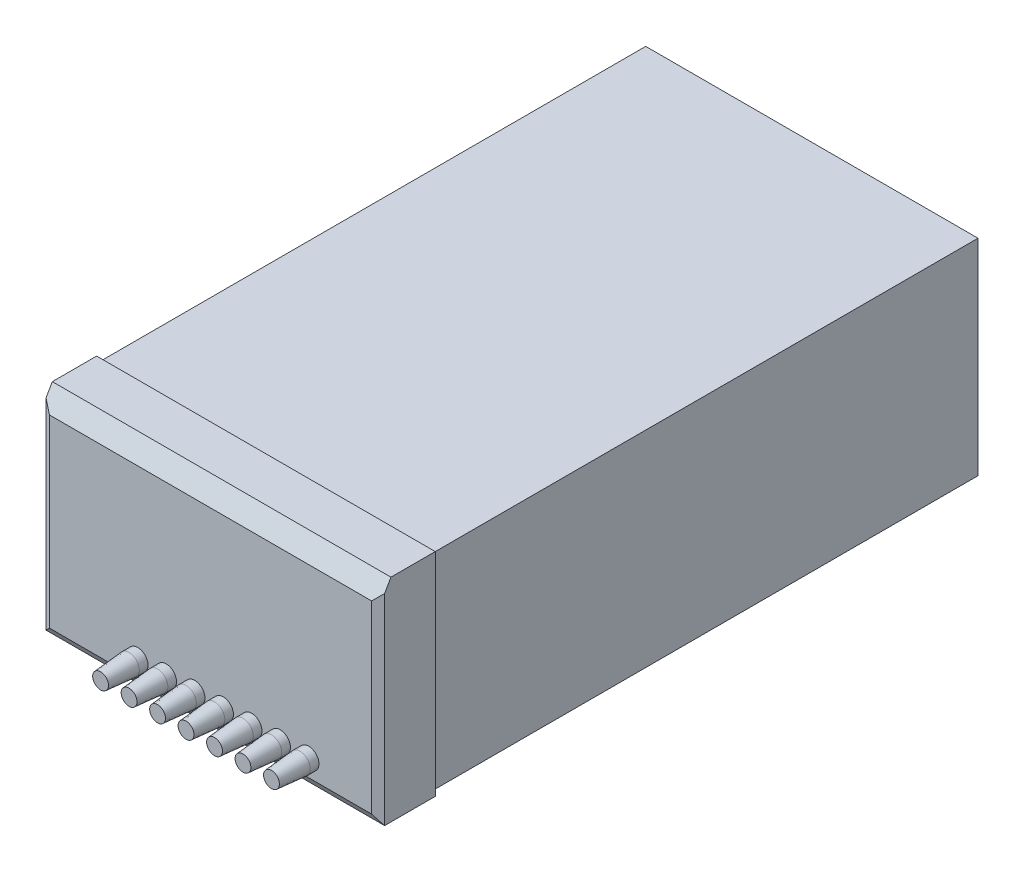
ISO-10303-21;
HEADER;
FILE_DESCRIPTION(('STEP AP214'),'2;1');
FILE_NAME('part.step','',(''),(''),'','','');
FILE_SCHEMA(('AUTOMOTIVE_DESIGN { 1 0 10303 214 1 1 1 1 }'));
ENDSEC;
DATA;
#1=APPLICATION_CONTEXT('core data for automotive mechanical design processes');
#2=APPLICATION_PROTOCOL_DEFINITION('international standard','automotive_design',2000,#1);
#3=PRODUCT_CONTEXT('',#1,'mechanical');
#4=PRODUCT('Part','Part','',(#3));
#5=PRODUCT_RELATED_PRODUCT_CATEGORY('part','',(#4));
#6=PRODUCT_DEFINITION_FORMATION('','',#4);
#7=PRODUCT_DEFINITION_CONTEXT('part definition',#1,'design');
#8=PRODUCT_DEFINITION('design','',#6,#7);
#9=PRODUCT_DEFINITION_SHAPE('','',#8);
#10=(LENGTH_UNIT() NAMED_UNIT(*) SI_UNIT(.MILLI.,.METRE.));
#11=(NAMED_UNIT(*) PLANE_ANGLE_UNIT() SI_UNIT($,.RADIAN.));
#12=(NAMED_UNIT(*) SI_UNIT($,.STERADIAN.) SOLID_ANGLE_UNIT());
#13=UNCERTAINTY_MEASURE_WITH_UNIT(LENGTH_MEASURE(1.E-05),#10,'distance_accuracy_value','');
#14=(GEOMETRIC_REPRESENTATION_CONTEXT(3) GLOBAL_UNCERTAINTY_ASSIGNED_CONTEXT((#13)) GLOBAL_UNIT_ASSIGNED_CONTEXT((#10,
#11,#12)) REPRESENTATION_CONTEXT('',''));
#15=CARTESIAN_POINT('',(0.,0.,0.));
#16=DIRECTION('',(0.,0.,1.));
#17=DIRECTION('',(1.,0.,0.));
#18=AXIS2_PLACEMENT_3D('',#15,#16,#17);
#19=CARTESIAN_POINT('',(62.,-51.,40.5));
#20=DIRECTION('',(0.,0.,-1.));
#21=DIRECTION('',(-1.,0.,0.));
#22=AXIS2_PLACEMENT_3D('',#19,#20,#21);
#23=CYLINDRICAL_SURFACE('',#22,6.5);
#24=CARTESIAN_POINT('',(62.,-51.,40.5));
#25=DIRECTION('',(0.,0.,1.));
#26=DIRECTION('',(1.,0.,0.));
#27=AXIS2_PLACEMENT_3D('',#24,#25,#26);
#28=CIRCLE('',#27,6.50000000000001);
#29=CARTESIAN_POINT('',(68.5,-51.,40.5));
#30=VERTEX_POINT('',#29);
#31=EDGE_CURVE('E12',#30,#30,#28,.T.);
#32=ORIENTED_EDGE('',*,*,#31,.F.);
#33=EDGE_LOOP('',(#32));
#34=FACE_BOUND('',#33,.T.);
#35=CARTESIAN_POINT('',(62.,-51.,35.));
#36=DIRECTION('',(0.,0.,1.));
#37=DIRECTION('',(1.,0.,0.));
#38=AXIS2_PLACEMENT_3D('',#35,#36,#37);
#39=CIRCLE('',#38,6.5);
#40=CARTESIAN_POINT('',(68.5,-51.,35.));
#41=VERTEX_POINT('',#40);
#42=EDGE_CURVE('E73',#41,#41,#39,.T.);
#43=ORIENTED_EDGE('',*,*,#42,.T.);
#44=EDGE_LOOP('',(#43));
#45=FACE_BOUND('',#44,.T.);
#46=ADVANCED_FACE('F64',(#34,#45),#23,.T.);
#47=CARTESIAN_POINT('',(62.,-51.,35.));
#48=DIRECTION('',(0.,0.,1.));
#49=DIRECTION('',(1.,0.,0.));
#50=AXIS2_PLACEMENT_3D('',#47,#48,#49);
#51=PLANE('',#50);
#52=ORIENTED_EDGE('',*,*,#42,.F.);
#53=EDGE_LOOP('',(#52));
#54=FACE_BOUND('',#53,.T.);
#55=ADVANCED_FACE('F88',(#54),#51,.F.);
#56=CARTESIAN_POINT('',(62.,-51.,58.5));
#57=DIRECTION('',(0.,0.,1.));
#58=DIRECTION('',(1.,0.,0.));
#59=AXIS2_PLACEMENT_3D('',#56,#57,#58);
#60=PLANE('',#59);
#61=CARTESIAN_POINT('',(62.,-51.,58.5));
#62=DIRECTION('',(0.,0.,1.));
#63=DIRECTION('',(1.,0.,0.));
#64=AXIS2_PLACEMENT_3D('',#61,#62,#63);
#65=CIRCLE('',#64,5.);
#66=CARTESIAN_POINT('',(67.,-51.,58.5));
#67=VERTEX_POINT('',#66);
#68=EDGE_CURVE('E78',#67,#67,#65,.T.);
#69=ORIENTED_EDGE('',*,*,#68,.T.);
#70=EDGE_LOOP('',(#69));
#71=FACE_BOUND('',#70,.T.);
#72=ADVANCED_FACE('F92',(#71),#60,.T.);
#73=CARTESIAN_POINT('',(62.,-51.,58.5));
#74=DIRECTION('',(0.,0.,-1.));
#75=DIRECTION('',(-1.,0.,0.));
#76=AXIS2_PLACEMENT_3D('',#73,#74,#75);
#77=CONICAL_SURFACE('',#76,5.,0.0831412318884415);
#78=ORIENTED_EDGE('',*,*,#31,.T.);
#79=EDGE_LOOP('',(#78));
#80=FACE_BOUND('',#79,.T.);
#81=ORIENTED_EDGE('',*,*,#68,.F.);
#82=EDGE_LOOP('',(#81));
#83=FACE_BOUND('',#82,.T.);
#84=ADVANCED_FACE('F97',(#80,#83),#77,.T.);
#85=CLOSED_SHELL('',(#46,#55,#72,#84));
#86=MANIFOLD_SOLID_BREP('B2',#85);
#87=CARTESIAN_POINT('',(44.,-51.,40.5));
#88=DIRECTION('',(0.,0.,-1.));
#89=DIRECTION('',(-1.,0.,0.));
#90=AXIS2_PLACEMENT_3D('',#87,#88,#89);
#91=CYLINDRICAL_SURFACE('',#90,6.5);
#92=CARTESIAN_POINT('',(44.,-51.,40.5));
#93=DIRECTION('',(0.,0.,1.));
#94=DIRECTION('',(1.,0.,0.));
#95=AXIS2_PLACEMENT_3D('',#92,#93,#94);
#96=CIRCLE('',#95,6.5);
#97=CARTESIAN_POINT('',(50.5,-51.,40.5));
#98=VERTEX_POINT('',#97);
#99=EDGE_CURVE('E63',#98,#98,#96,.T.);
#100=ORIENTED_EDGE('',*,*,#99,.F.);
#101=EDGE_LOOP('',(#100));
#102=FACE_BOUND('',#101,.T.);
#103=CARTESIAN_POINT('',(44.,-51.,35.));
#104=DIRECTION('',(0.,0.,1.));
#105=DIRECTION('',(1.,0.,0.));
#106=AXIS2_PLACEMENT_3D('',#103,#104,#105);
#107=CIRCLE('',#106,6.5);
#108=CARTESIAN_POINT('',(50.5,-51.,35.));
#109=VERTEX_POINT('',#108);
#110=EDGE_CURVE('E193',#109,#109,#107,.T.);
#111=ORIENTED_EDGE('',*,*,#110,.T.);
#112=EDGE_LOOP('',(#111));
#113=FACE_BOUND('',#112,.T.);
#114=ADVANCED_FACE('F184',(#102,#113),#91,.T.);
#115=CARTESIAN_POINT('',(44.,-51.,35.));
#116=DIRECTION('',(0.,0.,1.));
#117=DIRECTION('',(1.,0.,0.));
#118=AXIS2_PLACEMENT_3D('',#115,#116,#117);
#119=PLANE('',#118);
#120=ORIENTED_EDGE('',*,*,#110,.F.);
#121=EDGE_LOOP('',(#120));
#122=FACE_BOUND('',#121,.T.);
#123=ADVANCED_FACE('F208',(#122),#119,.F.);
#124=CARTESIAN_POINT('',(44.,-51.,58.5));
#125=DIRECTION('',(0.,0.,1.));
#126=DIRECTION('',(1.,0.,0.));
#127=AXIS2_PLACEMENT_3D('',#124,#125,#126);
#128=PLANE('',#127);
#129=CARTESIAN_POINT('',(44.,-51.,58.5));
#130=DIRECTION('',(0.,0.,1.));
#131=DIRECTION('',(1.,0.,0.));
#132=AXIS2_PLACEMENT_3D('',#129,#130,#131);
#133=CIRCLE('',#132,5.);
#134=CARTESIAN_POINT('',(49.,-51.,58.5));
#135=VERTEX_POINT('',#134);
#136=EDGE_CURVE('E198',#135,#135,#133,.T.);
#137=ORIENTED_EDGE('',*,*,#136,.T.);
#138=EDGE_LOOP('',(#137));
#139=FACE_BOUND('',#138,.T.);
#140=ADVANCED_FACE('F212',(#139),#128,.T.);
#141=CARTESIAN_POINT('',(44.,-51.,58.5));
#142=DIRECTION('',(0.,0.,-1.));
#143=DIRECTION('',(-1.,0.,0.));
#144=AXIS2_PLACEMENT_3D('',#141,#142,#143);
#145=CONICAL_SURFACE('',#144,5.,0.0831412318884415);
#146=ORIENTED_EDGE('',*,*,#99,.T.);
#147=EDGE_LOOP('',(#146));
#148=FACE_BOUND('',#147,.T.);
#149=ORIENTED_EDGE('',*,*,#136,.F.);
#150=EDGE_LOOP('',(#149));
#151=FACE_BOUND('',#150,.T.);
#152=ADVANCED_FACE('F217',(#148,#151),#145,.T.);
#153=CLOSED_SHELL('',(#114,#123,#140,#152));
#154=MANIFOLD_SOLID_BREP('B7',#153);
#155=CARTESIAN_POINT('',(26.,-51.,40.5));
#156=DIRECTION('',(0.,0.,-1.));
#157=DIRECTION('',(-1.,0.,0.));
#158=AXIS2_PLACEMENT_3D('',#155,#156,#157);
#159=CYLINDRICAL_SURFACE('',#158,6.5);
#160=CARTESIAN_POINT('',(26.,-51.,40.5));
#161=DIRECTION('',(0.,0.,1.));
#162=DIRECTION('',(1.,0.,0.));
#163=AXIS2_PLACEMENT_3D('',#160,#161,#162);
#164=CIRCLE('',#163,6.5);
#165=CARTESIAN_POINT('',(32.5,-51.,40.5));
#166=VERTEX_POINT('',#165);
#167=EDGE_CURVE('E183',#166,#166,#164,.T.);
#168=ORIENTED_EDGE('',*,*,#167,.F.);
#169=EDGE_LOOP('',(#168));
#170=FACE_BOUND('',#169,.T.);
#171=CARTESIAN_POINT('',(26.,-51.,35.));
#172=DIRECTION('',(0.,0.,1.));
#173=DIRECTION('',(1.,0.,0.));
#174=AXIS2_PLACEMENT_3D('',#171,#172,#173);
#175=CIRCLE('',#174,6.5);
#176=CARTESIAN_POINT('',(32.5,-51.,35.));
#177=VERTEX_POINT('',#176);
#178=EDGE_CURVE('E313',#177,#177,#175,.T.);
#179=ORIENTED_EDGE('',*,*,#178,.T.);
#180=EDGE_LOOP('',(#179));
#181=FACE_BOUND('',#180,.T.);
#182=ADVANCED_FACE('F304',(#170,#181),#159,.T.);
#183=CARTESIAN_POINT('',(26.,-51.,35.));
#184=DIRECTION('',(0.,0.,1.));
#185=DIRECTION('',(1.,0.,0.));
#186=AXIS2_PLACEMENT_3D('',#183,#184,#185);
#187=PLANE('',#186);
#188=ORIENTED_EDGE('',*,*,#178,.F.);
#189=EDGE_LOOP('',(#188));
#190=FACE_BOUND('',#189,.T.);
#191=ADVANCED_FACE('F328',(#190),#187,.F.);
#192=CARTESIAN_POINT('',(26.,-51.,58.5));
#193=DIRECTION('',(0.,0.,1.));
#194=DIRECTION('',(1.,0.,0.));
#195=AXIS2_PLACEMENT_3D('',#192,#193,#194);
#196=PLANE('',#195);
#197=CARTESIAN_POINT('',(26.,-51.,58.5));
#198=DIRECTION('',(0.,0.,1.));
#199=DIRECTION('',(1.,0.,0.));
#200=AXIS2_PLACEMENT_3D('',#197,#198,#199);
#201=CIRCLE('',#200,5.);
#202=CARTESIAN_POINT('',(31.,-51.,58.5));
#203=VERTEX_POINT('',#202);
#204=EDGE_CURVE('E318',#203,#203,#201,.T.);
#205=ORIENTED_EDGE('',*,*,#204,.T.);
#206=EDGE_LOOP('',(#205));
#207=FACE_BOUND('',#206,.T.);
#208=ADVANCED_FACE('F332',(#207),#196,.T.);
#209=CARTESIAN_POINT('',(26.,-51.,58.5));
#210=DIRECTION('',(0.,0.,-1.));
#211=DIRECTION('',(-1.,0.,0.));
#212=AXIS2_PLACEMENT_3D('',#209,#210,#211);
#213=CONICAL_SURFACE('',#212,5.,0.0831412318884415);
#214=ORIENTED_EDGE('',*,*,#167,.T.);
#215=EDGE_LOOP('',(#214));
#216=FACE_BOUND('',#215,.T.);
#217=ORIENTED_EDGE('',*,*,#204,.F.);
#218=EDGE_LOOP('',(#217));
#219=FACE_BOUND('',#218,.T.);
#220=ADVANCED_FACE('F337',(#216,#219),#213,.T.);
#221=CLOSED_SHELL('',(#182,#191,#208,#220));
#222=MANIFOLD_SOLID_BREP('B58',#221);
#223=CARTESIAN_POINT('',(7.99999999999998,-51.,40.5));
#224=DIRECTION('',(0.,0.,-1.));
#225=DIRECTION('',(-1.,0.,0.));
#226=AXIS2_PLACEMENT_3D('',#223,#224,#225);
#227=CYLINDRICAL_SURFACE('',#226,6.5);
#228=CARTESIAN_POINT('',(7.99999999999998,-51.,40.5));
#229=DIRECTION('',(0.,0.,1.));
#230=DIRECTION('',(1.,0.,0.));
#231=AXIS2_PLACEMENT_3D('',#228,#229,#230);
#232=CIRCLE('',#231,6.5);
#233=CARTESIAN_POINT('',(14.5,-51.,40.5));
#234=VERTEX_POINT('',#233);
#235=EDGE_CURVE('E303',#234,#234,#232,.T.);
#236=ORIENTED_EDGE('',*,*,#235,.F.);
#237=EDGE_LOOP('',(#236));
#238=FACE_BOUND('',#237,.T.);
#239=CARTESIAN_POINT('',(7.99999999999998,-51.,35.));
#240=DIRECTION('',(0.,0.,1.));
#241=DIRECTION('',(1.,0.,0.));
#242=AXIS2_PLACEMENT_3D('',#239,#240,#241);
#243=CIRCLE('',#242,6.5);
#244=CARTESIAN_POINT('',(14.5,-51.,35.));
#245=VERTEX_POINT('',#244);
#246=EDGE_CURVE('E433',#245,#245,#243,.T.);
#247=ORIENTED_EDGE('',*,*,#246,.T.);
#248=EDGE_LOOP('',(#247));
#249=FACE_BOUND('',#248,.T.);
#250=ADVANCED_FACE('F424',(#238,#249),#227,.T.);
#251=CARTESIAN_POINT('',(7.99999999999998,-51.,35.));
#252=DIRECTION('',(0.,0.,1.));
#253=DIRECTION('',(1.,0.,0.));
#254=AXIS2_PLACEMENT_3D('',#251,#252,#253);
#255=PLANE('',#254);
#256=ORIENTED_EDGE('',*,*,#246,.F.);
#257=EDGE_LOOP('',(#256));
#258=FACE_BOUND('',#257,.T.);
#259=ADVANCED_FACE('F448',(#258),#255,.F.);
#260=CARTESIAN_POINT('',(7.99999999999998,-51.,58.5));
#261=DIRECTION('',(0.,0.,1.));
#262=DIRECTION('',(1.,0.,0.));
#263=AXIS2_PLACEMENT_3D('',#260,#261,#262);
#264=PLANE('',#263);
#265=CARTESIAN_POINT('',(7.99999999999998,-51.,58.5));
#266=DIRECTION('',(0.,0.,1.));
#267=DIRECTION('',(1.,0.,0.));
#268=AXIS2_PLACEMENT_3D('',#265,#266,#267);
#269=CIRCLE('',#268,5.);
#270=CARTESIAN_POINT('',(13.,-51.,58.5));
#271=VERTEX_POINT('',#270);
#272=EDGE_CURVE('E438',#271,#271,#269,.T.);
#273=ORIENTED_EDGE('',*,*,#272,.T.);
#274=EDGE_LOOP('',(#273));
#275=FACE_BOUND('',#274,.T.);
#276=ADVANCED_FACE('F452',(#275),#264,.T.);
#277=CARTESIAN_POINT('',(7.99999999999998,-51.,58.5));
#278=DIRECTION('',(0.,0.,-1.));
#279=DIRECTION('',(-1.,0.,0.));
#280=AXIS2_PLACEMENT_3D('',#277,#278,#279);
#281=CONICAL_SURFACE('',#280,5.,0.0831412318884415);
#282=ORIENTED_EDGE('',*,*,#235,.T.);
#283=EDGE_LOOP('',(#282));
#284=FACE_BOUND('',#283,.T.);
#285=ORIENTED_EDGE('',*,*,#272,.F.);
#286=EDGE_LOOP('',(#285));
#287=FACE_BOUND('',#286,.T.);
#288=ADVANCED_FACE('F457',(#284,#287),#281,.T.);
#289=CLOSED_SHELL('',(#250,#259,#276,#288));
#290=MANIFOLD_SOLID_BREP('B178',#289);
#291=CARTESIAN_POINT('',(-10.,-51.,40.5));
#292=DIRECTION('',(0.,0.,-1.));
#293=DIRECTION('',(-1.,0.,0.));
#294=AXIS2_PLACEMENT_3D('',#291,#292,#293);
#295=CYLINDRICAL_SURFACE('',#294,6.5);
#296=CARTESIAN_POINT('',(-10.,-51.,40.5));
#297=DIRECTION('',(0.,0.,1.));
#298=DIRECTION('',(1.,0.,0.));
#299=AXIS2_PLACEMENT_3D('',#296,#297,#298);
#300=CIRCLE('',#299,6.5);
#301=CARTESIAN_POINT('',(-3.50000000000002,-51.,40.5));
#302=VERTEX_POINT('',#301);
#303=EDGE_CURVE('E423',#302,#302,#300,.T.);
#304=ORIENTED_EDGE('',*,*,#303,.F.);
#305=EDGE_LOOP('',(#304));
#306=FACE_BOUND('',#305,.T.);
#307=CARTESIAN_POINT('',(-10.,-51.,35.));
#308=DIRECTION('',(0.,0.,1.));
#309=DIRECTION('',(1.,0.,0.));
#310=AXIS2_PLACEMENT_3D('',#307,#308,#309);
#311=CIRCLE('',#310,6.5);
#312=CARTESIAN_POINT('',(-3.50000000000002,-51.,35.));
#313=VERTEX_POINT('',#312);
#314=EDGE_CURVE('E553',#313,#313,#311,.T.);
#315=ORIENTED_EDGE('',*,*,#314,.T.);
#316=EDGE_LOOP('',(#315));
#317=FACE_BOUND('',#316,.T.);
#318=ADVANCED_FACE('F544',(#306,#317),#295,.T.);
#319=CARTESIAN_POINT('',(-10.,-51.,35.));
#320=DIRECTION('',(0.,0.,1.));
#321=DIRECTION('',(1.,0.,0.));
#322=AXIS2_PLACEMENT_3D('',#319,#320,#321);
#323=PLANE('',#322);
#324=ORIENTED_EDGE('',*,*,#314,.F.);
#325=EDGE_LOOP('',(#324));
#326=FACE_BOUND('',#325,.T.);
#327=ADVANCED_FACE('F568',(#326),#323,.F.);
#328=CARTESIAN_POINT('',(-10.,-51.,58.5));
#329=DIRECTION('',(0.,0.,1.));
#330=DIRECTION('',(1.,0.,0.));
#331=AXIS2_PLACEMENT_3D('',#328,#329,#330);
#332=PLANE('',#331);
#333=CARTESIAN_POINT('',(-10.,-51.,58.5));
#334=DIRECTION('',(0.,0.,1.));
#335=DIRECTION('',(1.,0.,0.));
#336=AXIS2_PLACEMENT_3D('',#333,#334,#335);
#337=CIRCLE('',#336,5.);
#338=CARTESIAN_POINT('',(-5.00000000000002,-51.,58.5));
#339=VERTEX_POINT('',#338);
#340=EDGE_CURVE('E558',#339,#339,#337,.T.);
#341=ORIENTED_EDGE('',*,*,#340,.T.);
#342=EDGE_LOOP('',(#341));
#343=FACE_BOUND('',#342,.T.);
#344=ADVANCED_FACE('F572',(#343),#332,.T.);
#345=CARTESIAN_POINT('',(-10.,-51.,58.5));
#346=DIRECTION('',(0.,0.,-1.));
#347=DIRECTION('',(-1.,0.,0.));
#348=AXIS2_PLACEMENT_3D('',#345,#346,#347);
#349=CONICAL_SURFACE('',#348,5.,0.0831412318884415);
#350=ORIENTED_EDGE('',*,*,#303,.T.);
#351=EDGE_LOOP('',(#350));
#352=FACE_BOUND('',#351,.T.);
#353=ORIENTED_EDGE('',*,*,#340,.F.);
#354=EDGE_LOOP('',(#353));
#355=FACE_BOUND('',#354,.T.);
#356=ADVANCED_FACE('F577',(#352,#355),#349,.T.);
#357=CLOSED_SHELL('',(#318,#327,#344,#356));
#358=MANIFOLD_SOLID_BREP('B298',#357);
#359=CARTESIAN_POINT('',(-28.,-51.,40.5));
#360=DIRECTION('',(0.,0.,-1.));
#361=DIRECTION('',(-1.,0.,0.));
#362=AXIS2_PLACEMENT_3D('',#359,#360,#361);
#363=CYLINDRICAL_SURFACE('',#362,6.5);
#364=CARTESIAN_POINT('',(-28.,-51.,40.5));
#365=DIRECTION('',(0.,0.,1.));
#366=DIRECTION('',(1.,0.,0.));
#367=AXIS2_PLACEMENT_3D('',#364,#365,#366);
#368=CIRCLE('',#367,6.5);
#369=CARTESIAN_POINT('',(-21.5,-51.,40.5));
#370=VERTEX_POINT('',#369);
#371=EDGE_CURVE('E543',#370,#370,#368,.T.);
#372=ORIENTED_EDGE('',*,*,#371,.F.);
#373=EDGE_LOOP('',(#372));
#374=FACE_BOUND('',#373,.T.);
#375=CARTESIAN_POINT('',(-28.,-51.,35.));
#376=DIRECTION('',(0.,0.,1.));
#377=DIRECTION('',(1.,0.,0.));
#378=AXIS2_PLACEMENT_3D('',#375,#376,#377);
#379=CIRCLE('',#378,6.5);
#380=CARTESIAN_POINT('',(-21.5,-51.,35.));
#381=VERTEX_POINT('',#380);
#382=EDGE_CURVE('E673',#381,#381,#379,.T.);
#383=ORIENTED_EDGE('',*,*,#382,.T.);
#384=EDGE_LOOP('',(#383));
#385=FACE_BOUND('',#384,.T.);
#386=ADVANCED_FACE('F664',(#374,#385),#363,.T.);
#387=CARTESIAN_POINT('',(-28.,-51.,35.));
#388=DIRECTION('',(0.,0.,1.));
#389=DIRECTION('',(1.,0.,0.));
#390=AXIS2_PLACEMENT_3D('',#387,#388,#389);
#391=PLANE('',#390);
#392=ORIENTED_EDGE('',*,*,#382,.F.);
#393=EDGE_LOOP('',(#392));
#394=FACE_BOUND('',#393,.T.);
#395=ADVANCED_FACE('F688',(#394),#391,.F.);
#396=CARTESIAN_POINT('',(-28.,-51.,58.5));
#397=DIRECTION('',(0.,0.,1.));
#398=DIRECTION('',(1.,0.,0.));
#399=AXIS2_PLACEMENT_3D('',#396,#397,#398);
#400=PLANE('',#399);
#401=CARTESIAN_POINT('',(-28.,-51.,58.5));
#402=DIRECTION('',(0.,0.,1.));
#403=DIRECTION('',(1.,0.,0.));
#404=AXIS2_PLACEMENT_3D('',#401,#402,#403);
#405=CIRCLE('',#404,5.);
#406=CARTESIAN_POINT('',(-23.,-51.,58.5));
#407=VERTEX_POINT('',#406);
#408=EDGE_CURVE('E678',#407,#407,#405,.T.);
#409=ORIENTED_EDGE('',*,*,#408,.T.);
#410=EDGE_LOOP('',(#409));
#411=FACE_BOUND('',#410,.T.);
#412=ADVANCED_FACE('F692',(#411),#400,.T.);
#413=CARTESIAN_POINT('',(-28.,-51.,58.5));
#414=DIRECTION('',(0.,0.,-1.));
#415=DIRECTION('',(-1.,0.,0.));
#416=AXIS2_PLACEMENT_3D('',#413,#414,#415);
#417=CONICAL_SURFACE('',#416,5.,0.0831412318884415);
#418=ORIENTED_EDGE('',*,*,#371,.T.);
#419=EDGE_LOOP('',(#418));
#420=FACE_BOUND('',#419,.T.);
#421=ORIENTED_EDGE('',*,*,#408,.F.);
#422=EDGE_LOOP('',(#421));
#423=FACE_BOUND('',#422,.T.);
#424=ADVANCED_FACE('F697',(#420,#423),#417,.T.);
#425=CLOSED_SHELL('',(#386,#395,#412,#424));
#426=MANIFOLD_SOLID_BREP('B418',#425);
#427=CARTESIAN_POINT('',(-46.,-51.,40.5));
#428=DIRECTION('',(0.,0.,-1.));
#429=DIRECTION('',(-1.,0.,0.));
#430=AXIS2_PLACEMENT_3D('',#427,#428,#429);
#431=CYLINDRICAL_SURFACE('',#430,6.5);
#432=CARTESIAN_POINT('',(-46.,-51.,40.5));
#433=DIRECTION('',(0.,0.,-1.));
#434=DIRECTION('',(-1.,0.,0.));
#435=AXIS2_PLACEMENT_3D('',#432,#433,#434);
#436=CIRCLE('',#435,6.5);
#437=CARTESIAN_POINT('',(-52.5,-51.,40.5));
#438=VERTEX_POINT('',#437);
#439=EDGE_CURVE('E663',#438,#438,#436,.F.);
#440=ORIENTED_EDGE('',*,*,#439,.F.);
#441=EDGE_LOOP('',(#440));
#442=FACE_BOUND('',#441,.T.);
#443=CARTESIAN_POINT('',(-46.,-51.,35.));
#444=DIRECTION('',(0.,0.,1.));
#445=DIRECTION('',(1.,0.,0.));
#446=AXIS2_PLACEMENT_3D('',#443,#444,#445);
#447=CIRCLE('',#446,6.5);
#448=CARTESIAN_POINT('',(-39.5,-51.,35.));
#449=VERTEX_POINT('',#448);
#450=EDGE_CURVE('E793',#449,#449,#447,.T.);
#451=ORIENTED_EDGE('',*,*,#450,.T.);
#452=EDGE_LOOP('',(#451));
#453=FACE_BOUND('',#452,.T.);
#454=ADVANCED_FACE('F786',(#442,#453),#431,.T.);
#455=CARTESIAN_POINT('',(-46.,-51.,35.));
#456=DIRECTION('',(0.,0.,1.));
#457=DIRECTION('',(1.,0.,0.));
#458=AXIS2_PLACEMENT_3D('',#455,#456,#457);
#459=PLANE('',#458);
#460=ORIENTED_EDGE('',*,*,#450,.F.);
#461=EDGE_LOOP('',(#460));
#462=FACE_BOUND('',#461,.T.);
#463=ADVANCED_FACE('F819',(#462),#459,.F.);
#464=CARTESIAN_POINT('',(-46.,-51.,58.5));
#465=DIRECTION('',(0.,0.,1.));
#466=DIRECTION('',(1.,0.,0.));
#467=AXIS2_PLACEMENT_3D('',#464,#465,#466);
#468=PLANE('',#467);
#469=CARTESIAN_POINT('',(-46.,-51.,58.5));
#470=DIRECTION('',(0.,0.,1.));
#471=DIRECTION('',(1.,0.,0.));
#472=AXIS2_PLACEMENT_3D('',#469,#470,#471);
#473=CIRCLE('',#472,5.);
#474=CARTESIAN_POINT('',(-41.,-51.,58.5));
#475=VERTEX_POINT('',#474);
#476=EDGE_CURVE('E797',#475,#475,#473,.T.);
#477=ORIENTED_EDGE('',*,*,#476,.T.);
#478=EDGE_LOOP('',(#477));
#479=FACE_BOUND('',#478,.T.);
#480=ADVANCED_FACE('F809',(#479),#468,.T.);
#481=CARTESIAN_POINT('',(-46.,-51.,58.5));
#482=DIRECTION('',(0.,0.,-1.));
#483=DIRECTION('',(-1.,0.,0.));
#484=AXIS2_PLACEMENT_3D('',#481,#482,#483);
#485=CONICAL_SURFACE('',#484,5.,0.0831412318884415);
#486=ORIENTED_EDGE('',*,*,#439,.T.);
#487=EDGE_LOOP('',(#486));
#488=FACE_BOUND('',#487,.T.);
#489=ORIENTED_EDGE('',*,*,#476,.F.);
#490=EDGE_LOOP('',(#489));
#491=FACE_BOUND('',#490,.T.);
#492=ADVANCED_FACE('F818',(#488,#491),#485,.T.);
#493=CLOSED_SHELL('',(#454,#463,#480,#492));
#494=MANIFOLD_SOLID_BREP('B538',#493);
#495=CARTESIAN_POINT('',(-107.,-67.,35.));
#496=DIRECTION('',(0.,1.,0.));
#497=DIRECTION('',(0.,0.,1.));
#498=AXIS2_PLACEMENT_3D('',#495,#496,#497);
#499=PLANE('',#498);
#500=DIRECTION('',(0.,0.,-1.));
#501=VECTOR('',#500,1.);
#502=CARTESIAN_POINT('',(107.,-67.,35.));
#503=LINE('',#502,#501);
#504=CARTESIAN_POINT('',(107.,-67.,32.));
#505=VERTEX_POINT('',#504);
#506=CARTESIAN_POINT('',(107.,-67.,0.));
#507=VERTEX_POINT('',#506);
#508=EDGE_CURVE('E949',#505,#507,#503,.T.);
#509=ORIENTED_EDGE('',*,*,#508,.F.);
#510=DIRECTION('',(-1.,0.,0.));
#511=VECTOR('',#510,1.);
#512=CARTESIAN_POINT('',(-107.,-67.,32.));
#513=LINE('',#512,#511);
#514=CARTESIAN_POINT('',(-107.,-67.,32.));
#515=VERTEX_POINT('',#514);
#516=EDGE_CURVE('E900',#505,#515,#513,.T.);
#517=ORIENTED_EDGE('',*,*,#516,.T.);
#518=DIRECTION('',(0.,0.,-1.));
#519=VECTOR('',#518,1.);
#520=CARTESIAN_POINT('',(-107.,-67.,35.));
#521=LINE('',#520,#519);
#522=CARTESIAN_POINT('',(-107.,-67.,0.));
#523=VERTEX_POINT('',#522);
#524=EDGE_CURVE('E967',#515,#523,#521,.T.);
#525=ORIENTED_EDGE('',*,*,#524,.T.);
#526=DIRECTION('',(1.,0.,0.));
#527=VECTOR('',#526,1.);
#528=CARTESIAN_POINT('',(-107.,-67.,0.));
#529=LINE('',#528,#527);
#530=EDGE_CURVE('E963',#523,#507,#529,.T.);
#531=ORIENTED_EDGE('',*,*,#530,.T.);
#532=EDGE_LOOP('',(#509,#517,#525,#531));
#533=FACE_BOUND('',#532,.T.);
#534=ADVANCED_FACE('F890',(#533),#499,.F.);
#535=CARTESIAN_POINT('',(107.,-67.,35.));
#536=DIRECTION('',(-1.,0.,0.));
#537=DIRECTION('',(0.,0.,1.));
#538=AXIS2_PLACEMENT_3D('',#535,#536,#537);
#539=PLANE('',#538);
#540=DIRECTION('',(0.,-0.866025403784438,0.500000000000002));
#541=VECTOR('',#540,1.);
#542=CARTESIAN_POINT('',(107.,54.8756443470179,35.));
#543=LINE('',#542,#541);
#544=CARTESIAN_POINT('',(107.,67.,28.));
#545=VERTEX_POINT('',#544);
#546=CARTESIAN_POINT('',(107.,60.0717967697245,32.));
#547=VERTEX_POINT('',#546);
#548=EDGE_CURVE('E986',#545,#547,#543,.T.);
#549=ORIENTED_EDGE('',*,*,#548,.T.);
#550=DIRECTION('',(0.,-1.,0.));
#551=VECTOR('',#550,1.);
#552=CARTESIAN_POINT('',(107.,-67.,32.));
#553=LINE('',#552,#551);
#554=EDGE_CURVE('E915',#547,#505,#553,.T.);
#555=ORIENTED_EDGE('',*,*,#554,.T.);
#556=ORIENTED_EDGE('',*,*,#508,.T.);
#557=DIRECTION('',(0.,1.,0.));
#558=VECTOR('',#557,1.);
#559=CARTESIAN_POINT('',(107.,-67.,0.));
#560=LINE('',#559,#558);
#561=CARTESIAN_POINT('',(107.,67.,0.));
#562=VERTEX_POINT('',#561);
#563=EDGE_CURVE('E953',#507,#562,#560,.T.);
#564=ORIENTED_EDGE('',*,*,#563,.T.);
#565=DIRECTION('',(0.,0.,-1.));
#566=VECTOR('',#565,1.);
#567=CARTESIAN_POINT('',(107.,67.,35.));
#568=LINE('',#567,#566);
#569=EDGE_CURVE('E957',#545,#562,#568,.T.);
#570=ORIENTED_EDGE('',*,*,#569,.F.);
#571=EDGE_LOOP('',(#549,#555,#556,#564,#570));
#572=FACE_BOUND('',#571,.T.);
#573=ADVANCED_FACE('F951',(#572),#539,.F.);
#574=CARTESIAN_POINT('',(107.,67.,35.));
#575=DIRECTION('',(0.,-1.,0.));
#576=DIRECTION('',(0.,0.,-1.));
#577=AXIS2_PLACEMENT_3D('',#574,#575,#576);
#578=PLANE('',#577);
#579=DIRECTION('',(0.,0.,-1.));
#580=VECTOR('',#579,1.);
#581=CARTESIAN_POINT('',(-107.,67.,35.));
#582=LINE('',#581,#580);
#583=CARTESIAN_POINT('',(-107.,67.,28.));
#584=VERTEX_POINT('',#583);
#585=CARTESIAN_POINT('',(-107.,67.,0.));
#586=VERTEX_POINT('',#585);
#587=EDGE_CURVE('E977',#584,#586,#582,.T.);
#588=ORIENTED_EDGE('',*,*,#587,.F.);
#589=DIRECTION('',(1.,0.,0.));
#590=VECTOR('',#589,1.);
#591=CARTESIAN_POINT('',(107.,67.,28.));
#592=LINE('',#591,#590);
#593=EDGE_CURVE('E984',#584,#545,#592,.T.);
#594=ORIENTED_EDGE('',*,*,#593,.T.);
#595=ORIENTED_EDGE('',*,*,#569,.T.);
#596=DIRECTION('',(-1.,0.,0.));
#597=VECTOR('',#596,1.);
#598=CARTESIAN_POINT('',(107.,67.,0.));
#599=LINE('',#598,#597);
#600=EDGE_CURVE('E965',#562,#586,#599,.T.);
#601=ORIENTED_EDGE('',*,*,#600,.T.);
#602=EDGE_LOOP('',(#588,#594,#595,#601));
#603=FACE_BOUND('',#602,.T.);
#604=ADVANCED_FACE('F1023',(#603),#578,.F.);
#605=CARTESIAN_POINT('',(-107.,67.,35.));
#606=DIRECTION('',(1.,0.,0.));
#607=DIRECTION('',(0.,0.,-1.));
#608=AXIS2_PLACEMENT_3D('',#605,#606,#607);
#609=PLANE('',#608);
#610=ORIENTED_EDGE('',*,*,#524,.F.);
#611=DIRECTION('',(0.,1.,0.));
#612=VECTOR('',#611,1.);
#613=CARTESIAN_POINT('',(-107.,54.8756443470179,32.));
#614=LINE('',#613,#612);
#615=CARTESIAN_POINT('',(-107.,60.0717967697245,32.));
#616=VERTEX_POINT('',#615);
#617=EDGE_CURVE('E784',#515,#616,#614,.T.);
#618=ORIENTED_EDGE('',*,*,#617,.T.);
#619=DIRECTION('',(0.,0.866025403784438,-0.500000000000002));
#620=VECTOR('',#619,1.);
#621=CARTESIAN_POINT('',(-107.,54.8756443470179,35.));
#622=LINE('',#621,#620);
#623=EDGE_CURVE('E982',#616,#584,#622,.T.);
#624=ORIENTED_EDGE('',*,*,#623,.T.);
#625=ORIENTED_EDGE('',*,*,#587,.T.);
#626=DIRECTION('',(0.,-1.,0.));
#627=VECTOR('',#626,1.);
#628=CARTESIAN_POINT('',(-107.,67.,0.));
#629=LINE('',#628,#627);
#630=EDGE_CURVE('E974',#586,#523,#629,.T.);
#631=ORIENTED_EDGE('',*,*,#630,.T.);
#632=EDGE_LOOP('',(#610,#618,#624,#625,#631));
#633=FACE_BOUND('',#632,.T.);
#634=ADVANCED_FACE('F1015',(#633),#609,.F.);
#635=CARTESIAN_POINT('',(0.,0.,35.));
#636=DIRECTION('',(0.,0.,1.));
#637=DIRECTION('',(1.,0.,0.));
#638=AXIS2_PLACEMENT_3D('',#635,#636,#637);
#639=PLANE('',#638);
#640=DIRECTION('',(1.,0.,0.));
#641=VECTOR('',#640,1.);
#642=CARTESIAN_POINT('',(107.,-61.8038475772934,35.));
#643=LINE('',#642,#641);
#644=CARTESIAN_POINT('',(-101.803847577293,-61.8038475772934,35.));
#645=VERTEX_POINT('',#644);
#646=CARTESIAN_POINT('',(101.803847577293,-61.8038475772934,35.));
#647=VERTEX_POINT('',#646);
#648=EDGE_CURVE('E990',#645,#647,#643,.T.);
#649=ORIENTED_EDGE('',*,*,#648,.T.);
#650=DIRECTION('',(0.,1.,0.));
#651=VECTOR('',#650,1.);
#652=CARTESIAN_POINT('',(101.803847577293,54.8756443470179,35.));
#653=LINE('',#652,#651);
#654=CARTESIAN_POINT('',(101.803847577293,54.8756443470179,35.));
#655=VERTEX_POINT('',#654);
#656=EDGE_CURVE('E992',#647,#655,#653,.T.);
#657=ORIENTED_EDGE('',*,*,#656,.T.);
#658=DIRECTION('',(-1.,0.,0.));
#659=VECTOR('',#658,1.);
#660=CARTESIAN_POINT('',(-107.,54.8756443470179,35.));
#661=LINE('',#660,#659);
#662=CARTESIAN_POINT('',(-101.803847577293,54.8756443470179,35.));
#663=VERTEX_POINT('',#662);
#664=EDGE_CURVE('E956',#655,#663,#661,.T.);
#665=ORIENTED_EDGE('',*,*,#664,.T.);
#666=DIRECTION('',(0.,-1.,0.));
#667=VECTOR('',#666,1.);
#668=CARTESIAN_POINT('',(-101.803847577293,-67.,35.));
#669=LINE('',#668,#667);
#670=EDGE_CURVE('E988',#663,#645,#669,.T.);
#671=ORIENTED_EDGE('',*,*,#670,.T.);
#672=EDGE_LOOP('',(#649,#657,#665,#671));
#673=FACE_BOUND('',#672,.T.);
#674=ADVANCED_FACE('F1030',(#673),#639,.T.);
#675=CARTESIAN_POINT('',(0.,0.,0.));
#676=DIRECTION('',(0.,0.,1.));
#677=DIRECTION('',(1.,0.,0.));
#678=AXIS2_PLACEMENT_3D('',#675,#676,#677);
#679=PLANE('',#678);
#680=ORIENTED_EDGE('',*,*,#530,.F.);
#681=ORIENTED_EDGE('',*,*,#630,.F.);
#682=ORIENTED_EDGE('',*,*,#600,.F.);
#683=ORIENTED_EDGE('',*,*,#563,.F.);
#684=EDGE_LOOP('',(#680,#681,#682,#683));
#685=FACE_BOUND('',#684,.T.);
#686=ADVANCED_FACE('F961',(#685),#679,.F.);
#687=CARTESIAN_POINT('',(0.,54.8756443470179,35.));
#688=DIRECTION('',(0.,0.500000000000002,0.866025403784438));
#689=DIRECTION('',(1.,0.,0.));
#690=AXIS2_PLACEMENT_3D('',#687,#688,#689);
#691=PLANE('',#690);
#692=ORIENTED_EDGE('',*,*,#664,.F.);
#693=DIRECTION('',(0.654653670707975,0.654653670707978,-0.37796447300923));
#694=VECTOR('',#693,1.);
#695=CARTESIAN_POINT('',(58.1736271870251,11.2454239567494,60.1899194871243));
#696=LINE('',#695,#694);
#697=EDGE_CURVE('E997',#655,#547,#696,.T.);
#698=ORIENTED_EDGE('',*,*,#697,.T.);
#699=ORIENTED_EDGE('',*,*,#548,.F.);
#700=ORIENTED_EDGE('',*,*,#593,.F.);
#701=ORIENTED_EDGE('',*,*,#623,.F.);
#702=DIRECTION('',(0.654653670707975,-0.654653670707978,0.37796447300923));
#703=VECTOR('',#702,1.);
#704=CARTESIAN_POINT('',(-58.1736271870252,11.2454239567494,60.1899194871243));
#705=LINE('',#704,#703);
#706=EDGE_CURVE('E995',#616,#663,#705,.T.);
#707=ORIENTED_EDGE('',*,*,#706,.T.);
#708=EDGE_LOOP('',(#692,#698,#699,#700,#701,#707));
#709=FACE_BOUND('',#708,.T.);
#710=ADVANCED_FACE('F1020',(#709),#691,.T.);
#711=CARTESIAN_POINT('',(-101.803847577293,0.,35.));
#712=DIRECTION('',(-0.500000000000004,0.,0.866025403784436));
#713=DIRECTION('',(0.,1.,0.));
#714=AXIS2_PLACEMENT_3D('',#711,#712,#713);
#715=PLANE('',#714);
#716=ORIENTED_EDGE('',*,*,#706,.F.);
#717=ORIENTED_EDGE('',*,*,#617,.F.);
#718=DIRECTION('',(0.654653670707976,0.654653670707976,0.377964473009231));
#719=VECTOR('',#718,1.);
#720=CARTESIAN_POINT('',(-75.316484329882,-35.316484329882,50.2924863010165));
#721=LINE('',#720,#719);
#722=EDGE_CURVE('E895',#645,#515,#721,.F.);
#723=ORIENTED_EDGE('',*,*,#722,.F.);
#724=ORIENTED_EDGE('',*,*,#670,.F.);
#725=EDGE_LOOP('',(#716,#717,#723,#724));
#726=FACE_BOUND('',#725,.T.);
#727=ADVANCED_FACE('F893',(#726),#715,.T.);
#728=CARTESIAN_POINT('',(0.,-61.8038475772934,35.));
#729=DIRECTION('',(0.,-0.500000000000004,0.866025403784436));
#730=DIRECTION('',(-1.,0.,0.));
#731=AXIS2_PLACEMENT_3D('',#728,#729,#730);
#732=PLANE('',#731);
#733=ORIENTED_EDGE('',*,*,#722,.T.);
#734=ORIENTED_EDGE('',*,*,#516,.F.);
#735=DIRECTION('',(-0.654653670707976,0.654653670707976,0.377964473009231));
#736=VECTOR('',#735,1.);
#737=CARTESIAN_POINT('',(58.1736271870249,-18.1736271870249,60.1899194871245));
#738=LINE('',#737,#736);
#739=EDGE_CURVE('E971',#647,#505,#738,.F.);
#740=ORIENTED_EDGE('',*,*,#739,.F.);
#741=ORIENTED_EDGE('',*,*,#648,.F.);
#742=EDGE_LOOP('',(#733,#734,#740,#741));
#743=FACE_BOUND('',#742,.T.);
#744=ADVANCED_FACE('F1007',(#743),#732,.T.);
#745=CARTESIAN_POINT('',(101.803847577293,0.,35.));
#746=DIRECTION('',(0.500000000000004,0.,0.866025403784436));
#747=DIRECTION('',(0.,-1.,0.));
#748=AXIS2_PLACEMENT_3D('',#745,#746,#747);
#749=PLANE('',#748);
#750=ORIENTED_EDGE('',*,*,#739,.T.);
#751=ORIENTED_EDGE('',*,*,#554,.F.);
#752=ORIENTED_EDGE('',*,*,#697,.F.);
#753=ORIENTED_EDGE('',*,*,#656,.F.);
#754=EDGE_LOOP('',(#750,#751,#752,#753));
#755=FACE_BOUND('',#754,.T.);
#756=ADVANCED_FACE('F1004',(#755),#749,.T.);
#757=CLOSED_SHELL('',(#534,#573,#604,#634,#674,#686,#710,#727,#744,#756));
#758=MANIFOLD_SOLID_BREP('B658',#757);
#759=CARTESIAN_POINT('',(105.,-65.,-345.));
#760=DIRECTION('',(1.,0.,0.));
#761=DIRECTION('',(0.,0.,-1.));
#762=AXIS2_PLACEMENT_3D('',#759,#760,#761);
#763=PLANE('',#762);
#764=DIRECTION('',(0.,1.,0.));
#765=VECTOR('',#764,1.);
#766=CARTESIAN_POINT('',(105.,-65.,0.));
#767=LINE('',#766,#765);
#768=CARTESIAN_POINT('',(105.,-65.,0.));
#769=VERTEX_POINT('',#768);
#770=CARTESIAN_POINT('',(105.,65.,0.));
#771=VERTEX_POINT('',#770);
#772=EDGE_CURVE('E1188',#769,#771,#767,.T.);
#773=ORIENTED_EDGE('',*,*,#772,.F.);
#774=DIRECTION('',(0.,0.,1.));
#775=VECTOR('',#774,1.);
#776=CARTESIAN_POINT('',(105.,-65.,-345.));
#777=LINE('',#776,#775);
#778=CARTESIAN_POINT('',(105.,-65.,-345.));
#779=VERTEX_POINT('',#778);
#780=EDGE_CURVE('E888',#779,#769,#777,.T.);
#781=ORIENTED_EDGE('',*,*,#780,.F.);
#782=DIRECTION('',(0.,1.,0.));
#783=VECTOR('',#782,1.);
#784=CARTESIAN_POINT('',(105.,-65.,-345.));
#785=LINE('',#784,#783);
#786=CARTESIAN_POINT('',(105.,65.,-345.));
#787=VERTEX_POINT('',#786);
#788=EDGE_CURVE('E1180',#779,#787,#785,.T.);
#789=ORIENTED_EDGE('',*,*,#788,.T.);
#790=DIRECTION('',(0.,0.,1.));
#791=VECTOR('',#790,1.);
#792=CARTESIAN_POINT('',(105.,65.,-345.));
#793=LINE('',#792,#791);
#794=EDGE_CURVE('E1121',#787,#771,#793,.T.);
#795=ORIENTED_EDGE('',*,*,#794,.T.);
#796=EDGE_LOOP('',(#773,#781,#789,#795));
#797=FACE_BOUND('',#796,.T.);
#798=ADVANCED_FACE('F1118',(#797),#763,.T.);
#799=CARTESIAN_POINT('',(-105.,-65.,-345.));
#800=DIRECTION('',(0.,-1.,0.));
#801=DIRECTION('',(0.,0.,-1.));
#802=AXIS2_PLACEMENT_3D('',#799,#800,#801);
#803=PLANE('',#802);
#804=DIRECTION('',(1.,0.,0.));
#805=VECTOR('',#804,1.);
#806=CARTESIAN_POINT('',(-105.,-65.,0.));
#807=LINE('',#806,#805);
#808=CARTESIAN_POINT('',(-105.,-65.,0.));
#809=VERTEX_POINT('',#808);
#810=EDGE_CURVE('E1183',#809,#769,#807,.T.);
#811=ORIENTED_EDGE('',*,*,#810,.F.);
#812=DIRECTION('',(0.,0.,1.));
#813=VECTOR('',#812,1.);
#814=CARTESIAN_POINT('',(-105.,-65.,-345.));
#815=LINE('',#814,#813);
#816=CARTESIAN_POINT('',(-105.,-65.,-345.));
#817=VERTEX_POINT('',#816);
#818=EDGE_CURVE('E1128',#817,#809,#815,.T.);
#819=ORIENTED_EDGE('',*,*,#818,.F.);
#820=DIRECTION('',(1.,0.,0.));
#821=VECTOR('',#820,1.);
#822=CARTESIAN_POINT('',(-105.,-65.,-345.));
#823=LINE('',#822,#821);
#824=EDGE_CURVE('E1175',#817,#779,#823,.T.);
#825=ORIENTED_EDGE('',*,*,#824,.T.);
#826=ORIENTED_EDGE('',*,*,#780,.T.);
#827=EDGE_LOOP('',(#811,#819,#825,#826));
#828=FACE_BOUND('',#827,.T.);
#829=ADVANCED_FACE('F1204',(#828),#803,.T.);
#830=CARTESIAN_POINT('',(-105.,-65.,-345.));
#831=DIRECTION('',(-1.,0.,0.));
#832=DIRECTION('',(0.,0.,1.));
#833=AXIS2_PLACEMENT_3D('',#830,#831,#832);
#834=PLANE('',#833);
#835=DIRECTION('',(0.,-1.,0.));
#836=VECTOR('',#835,1.);
#837=CARTESIAN_POINT('',(-105.,-65.,0.));
#838=LINE('',#837,#836);
#839=CARTESIAN_POINT('',(-105.,65.,0.));
#840=VERTEX_POINT('',#839);
#841=EDGE_CURVE('E1169',#840,#809,#838,.T.);
#842=ORIENTED_EDGE('',*,*,#841,.F.);
#843=DIRECTION('',(0.,0.,1.));
#844=VECTOR('',#843,1.);
#845=CARTESIAN_POINT('',(-105.,65.,-345.));
#846=LINE('',#845,#844);
#847=CARTESIAN_POINT('',(-105.,65.,-345.));
#848=VERTEX_POINT('',#847);
#849=EDGE_CURVE('E1164',#848,#840,#846,.T.);
#850=ORIENTED_EDGE('',*,*,#849,.F.);
#851=DIRECTION('',(0.,-1.,0.));
#852=VECTOR('',#851,1.);
#853=CARTESIAN_POINT('',(-105.,-65.,-345.));
#854=LINE('',#853,#852);
#855=EDGE_CURVE('E1167',#848,#817,#854,.T.);
#856=ORIENTED_EDGE('',*,*,#855,.T.);
#857=ORIENTED_EDGE('',*,*,#818,.T.);
#858=EDGE_LOOP('',(#842,#850,#856,#857));
#859=FACE_BOUND('',#858,.T.);
#860=ADVANCED_FACE('F1166',(#859),#834,.T.);
#861=CARTESIAN_POINT('',(-105.,65.,-345.));
#862=DIRECTION('',(0.,1.,0.));
#863=DIRECTION('',(0.,0.,1.));
#864=AXIS2_PLACEMENT_3D('',#861,#862,#863);
#865=PLANE('',#864);
#866=DIRECTION('',(-1.,0.,0.));
#867=VECTOR('',#866,1.);
#868=CARTESIAN_POINT('',(-105.,65.,0.));
#869=LINE('',#868,#867);
#870=EDGE_CURVE('E1192',#771,#840,#869,.T.);
#871=ORIENTED_EDGE('',*,*,#870,.F.);
#872=ORIENTED_EDGE('',*,*,#794,.F.);
#873=DIRECTION('',(-1.,0.,0.));
#874=VECTOR('',#873,1.);
#875=CARTESIAN_POINT('',(-105.,65.,-345.));
#876=LINE('',#875,#874);
#877=EDGE_CURVE('E1174',#787,#848,#876,.T.);
#878=ORIENTED_EDGE('',*,*,#877,.T.);
#879=ORIENTED_EDGE('',*,*,#849,.T.);
#880=EDGE_LOOP('',(#871,#872,#878,#879));
#881=FACE_BOUND('',#880,.T.);
#882=ADVANCED_FACE('F1178',(#881),#865,.T.);
#883=CARTESIAN_POINT('',(0.,0.,-345.));
#884=DIRECTION('',(0.,0.,-1.));
#885=DIRECTION('',(-1.,0.,0.));
#886=AXIS2_PLACEMENT_3D('',#883,#884,#885);
#887=PLANE('',#886);
#888=ORIENTED_EDGE('',*,*,#788,.F.);
#889=ORIENTED_EDGE('',*,*,#824,.F.);
#890=ORIENTED_EDGE('',*,*,#855,.F.);
#891=ORIENTED_EDGE('',*,*,#877,.F.);
#892=EDGE_LOOP('',(#888,#889,#890,#891));
#893=FACE_BOUND('',#892,.T.);
#894=ADVANCED_FACE('F1173',(#893),#887,.T.);
#895=CARTESIAN_POINT('',(0.,0.,0.));
#896=DIRECTION('',(0.,0.,-1.));
#897=DIRECTION('',(-1.,0.,0.));
#898=AXIS2_PLACEMENT_3D('',#895,#896,#897);
#899=PLANE('',#898);
#900=ORIENTED_EDGE('',*,*,#772,.T.);
#901=ORIENTED_EDGE('',*,*,#870,.T.);
#902=ORIENTED_EDGE('',*,*,#841,.T.);
#903=ORIENTED_EDGE('',*,*,#810,.T.);
#904=EDGE_LOOP('',(#900,#901,#902,#903));
#905=FACE_BOUND('',#904,.T.);
#906=ADVANCED_FACE('F1203',(#905),#899,.F.);
#907=CLOSED_SHELL('',(#798,#829,#860,#882,#894,#906));
#908=MANIFOLD_SOLID_BREP('B778',#907);
#909=ADVANCED_BREP_SHAPE_REPRESENTATION('',(#18,#86,#154,#222,#290,#358,#426,#494,#758,#908),#14);
#910=SHAPE_DEFINITION_REPRESENTATION(#9,#909);
ENDSEC;
END-ISO-10303-21;
